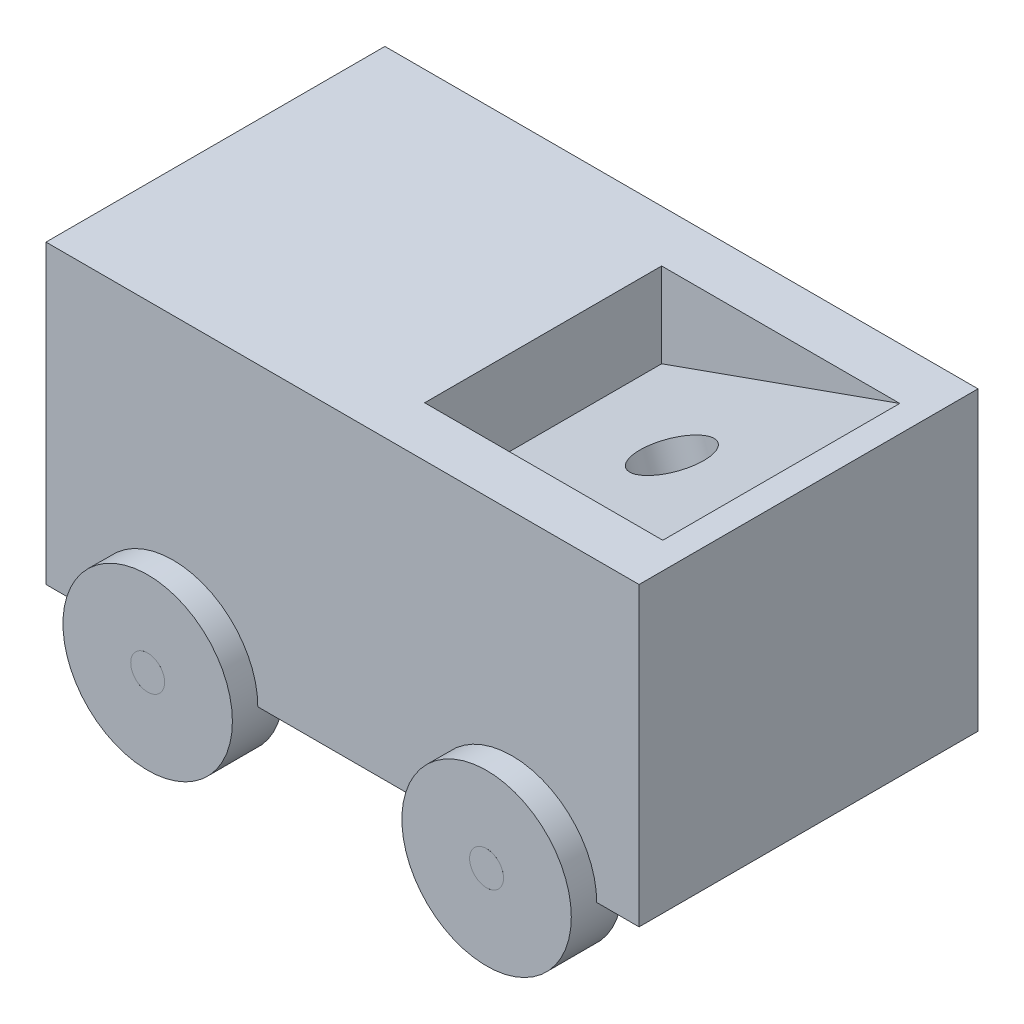
ISO-10303-21;
HEADER;
FILE_DESCRIPTION(('STEP AP214'),'2;1');
FILE_NAME('part.step','',(''),(''),'','','');
FILE_SCHEMA(('AUTOMOTIVE_DESIGN { 1 0 10303 214 1 1 1 1 }'));
ENDSEC;
DATA;
#1=APPLICATION_CONTEXT('core data for automotive mechanical design processes');
#2=APPLICATION_PROTOCOL_DEFINITION('international standard','automotive_design',2000,#1);
#3=PRODUCT_CONTEXT('',#1,'mechanical');
#4=PRODUCT('Part','Part','',(#3));
#5=PRODUCT_RELATED_PRODUCT_CATEGORY('part','',(#4));
#6=PRODUCT_DEFINITION_FORMATION('','',#4);
#7=PRODUCT_DEFINITION_CONTEXT('part definition',#1,'design');
#8=PRODUCT_DEFINITION('design','',#6,#7);
#9=PRODUCT_DEFINITION_SHAPE('','',#8);
#10=(LENGTH_UNIT() NAMED_UNIT(*) SI_UNIT(.MILLI.,.METRE.));
#11=(NAMED_UNIT(*) PLANE_ANGLE_UNIT() SI_UNIT($,.RADIAN.));
#12=(NAMED_UNIT(*) SI_UNIT($,.STERADIAN.) SOLID_ANGLE_UNIT());
#13=UNCERTAINTY_MEASURE_WITH_UNIT(LENGTH_MEASURE(1.E-05),#10,'distance_accuracy_value','');
#14=(GEOMETRIC_REPRESENTATION_CONTEXT(3) GLOBAL_UNCERTAINTY_ASSIGNED_CONTEXT((#13)) GLOBAL_UNIT_ASSIGNED_CONTEXT((#10,
#11,#12)) REPRESENTATION_CONTEXT('',''));
#15=CARTESIAN_POINT('',(0.,0.,0.));
#16=DIRECTION('',(0.,0.,1.));
#17=DIRECTION('',(1.,0.,0.));
#18=AXIS2_PLACEMENT_3D('',#15,#16,#17);
#19=CARTESIAN_POINT('',(-31.2286248123139,-10.,6.10846709352142));
#20=DIRECTION('',(0.,0.,-1.));
#21=DIRECTION('',(-1.,0.,0.));
#22=AXIS2_PLACEMENT_3D('',#19,#20,#21);
#23=PLANE('',#22);
#24=DIRECTION('',(-0.942142791010084,-0.335211815644569,0.));
#25=VECTOR('',#24,1.);
#26=CARTESIAN_POINT('',(-31.2286248123139,-10.,6.10846709352142));
#27=LINE('',#26,#25);
#28=CARTESIAN_POINT('',(-3.1227303587289,0.,6.10846709352142));
#29=VERTEX_POINT('',#28);
#30=CARTESIAN_POINT('',(-31.2286248123139,-10.,6.10846709352142));
#31=VERTEX_POINT('',#30);
#32=EDGE_CURVE('E459',#29,#31,#27,.T.);
#33=ORIENTED_EDGE('',*,*,#32,.F.);
#34=DIRECTION('',(-1.,0.,0.));
#35=VECTOR('',#34,1.);
#36=CARTESIAN_POINT('',(-31.2286248123139,0.,6.10846709352142));
#37=LINE('',#36,#35);
#38=CARTESIAN_POINT('',(-31.2286248123139,0.,6.10846709352142));
#39=VERTEX_POINT('',#38);
#40=EDGE_CURVE('E307',#29,#39,#37,.T.);
#41=ORIENTED_EDGE('',*,*,#40,.T.);
#42=DIRECTION('',(0.,1.,0.));
#43=VECTOR('',#42,1.);
#44=CARTESIAN_POINT('',(-31.2286248123139,-10.,6.10846709352142));
#45=LINE('',#44,#43);
#46=EDGE_CURVE('E320',#31,#39,#45,.T.);
#47=ORIENTED_EDGE('',*,*,#46,.F.);
#48=EDGE_LOOP('',(#33,#41,#47));
#49=FACE_BOUND('',#48,.T.);
#50=ADVANCED_FACE('F39',(#49),#23,.F.);
#51=CARTESIAN_POINT('',(-31.2286248123139,-10.,34.0804128909857));
#52=DIRECTION('',(0.,0.,1.));
#53=DIRECTION('',(1.,0.,0.));
#54=AXIS2_PLACEMENT_3D('',#51,#52,#53);
#55=PLANE('',#54);
#56=DIRECTION('',(0.942142791010084,0.335211815644569,0.));
#57=VECTOR('',#56,1.);
#58=CARTESIAN_POINT('',(-3.1227303587289,0.,34.0804128909857));
#59=LINE('',#58,#57);
#60=CARTESIAN_POINT('',(-31.2286248123139,-10.,34.0804128909857));
#61=VERTEX_POINT('',#60);
#62=CARTESIAN_POINT('',(-3.1227303587289,0.,34.0804128909857));
#63=VERTEX_POINT('',#62);
#64=EDGE_CURVE('E463',#61,#63,#59,.T.);
#65=ORIENTED_EDGE('',*,*,#64,.F.);
#66=DIRECTION('',(0.,1.,0.));
#67=VECTOR('',#66,1.);
#68=CARTESIAN_POINT('',(-31.2286248123139,-10.,34.0804128909857));
#69=LINE('',#68,#67);
#70=CARTESIAN_POINT('',(-31.2286248123139,0.,34.0804128909857));
#71=VERTEX_POINT('',#70);
#72=EDGE_CURVE('E306',#61,#71,#69,.T.);
#73=ORIENTED_EDGE('',*,*,#72,.T.);
#74=DIRECTION('',(1.,0.,0.));
#75=VECTOR('',#74,1.);
#76=CARTESIAN_POINT('',(-31.2286248123139,0.,34.0804128909857));
#77=LINE('',#76,#75);
#78=EDGE_CURVE('E310',#71,#63,#77,.T.);
#79=ORIENTED_EDGE('',*,*,#78,.T.);
#80=EDGE_LOOP('',(#65,#73,#79));
#81=FACE_BOUND('',#80,.T.);
#82=ADVANCED_FACE('F498',(#81),#55,.F.);
#83=CARTESIAN_POINT('',(0.,-35.,40.));
#84=DIRECTION('',(0.,1.,0.));
#85=DIRECTION('',(-1.,0.,0.));
#86=AXIS2_PLACEMENT_3D('',#83,#84,#85);
#87=PLANE('',#86);
#88=DIRECTION('',(1.,0.,0.));
#89=VECTOR('',#88,1.);
#90=CARTESIAN_POINT('',(0.,-35.,37.));
#91=LINE('',#90,#89);
#92=CARTESIAN_POINT('',(-13.,-35.,37.));
#93=VERTEX_POINT('',#92);
#94=CARTESIAN_POINT('',(-4.99999999999999,-35.,37.));
#95=VERTEX_POINT('',#94);
#96=EDGE_CURVE('E207',#93,#95,#91,.T.);
#97=ORIENTED_EDGE('',*,*,#96,.F.);
#98=DIRECTION('',(0.,0.,-1.));
#99=VECTOR('',#98,1.);
#100=CARTESIAN_POINT('',(-13.,-35.,43.));
#101=LINE('',#100,#99);
#102=CARTESIAN_POINT('',(-13.,-35.,3.));
#103=VERTEX_POINT('',#102);
#104=EDGE_CURVE('E382',#93,#103,#101,.T.);
#105=ORIENTED_EDGE('',*,*,#104,.T.);
#106=DIRECTION('',(-1.,0.,0.));
#107=VECTOR('',#106,1.);
#108=CARTESIAN_POINT('',(0.,-35.,3.));
#109=LINE('',#108,#107);
#110=CARTESIAN_POINT('',(-5.,-35.,3.));
#111=VERTEX_POINT('',#110);
#112=EDGE_CURVE('E11',#111,#103,#109,.T.);
#113=ORIENTED_EDGE('',*,*,#112,.F.);
#114=DIRECTION('',(0.,0.,-1.));
#115=VECTOR('',#114,1.);
#116=CARTESIAN_POINT('',(-5.,-35.,3.));
#117=LINE('',#116,#115);
#118=CARTESIAN_POINT('',(-5.,-35.,0.));
#119=VERTEX_POINT('',#118);
#120=EDGE_CURVE('E273',#111,#119,#117,.T.);
#121=ORIENTED_EDGE('',*,*,#120,.T.);
#122=DIRECTION('',(1.,0.,0.));
#123=VECTOR('',#122,1.);
#124=CARTESIAN_POINT('',(0.,-35.,0.));
#125=LINE('',#124,#123);
#126=CARTESIAN_POINT('',(0.,-35.,0.));
#127=VERTEX_POINT('',#126);
#128=EDGE_CURVE('E349',#119,#127,#125,.T.);
#129=ORIENTED_EDGE('',*,*,#128,.T.);
#130=DIRECTION('',(0.,0.,-1.));
#131=VECTOR('',#130,1.);
#132=CARTESIAN_POINT('',(0.,-35.,40.));
#133=LINE('',#132,#131);
#134=CARTESIAN_POINT('',(0.,-35.,40.));
#135=VERTEX_POINT('',#134);
#136=EDGE_CURVE('E196',#135,#127,#133,.T.);
#137=ORIENTED_EDGE('',*,*,#136,.F.);
#138=DIRECTION('',(1.,0.,0.));
#139=VECTOR('',#138,1.);
#140=CARTESIAN_POINT('',(0.,-35.,40.));
#141=LINE('',#140,#139);
#142=CARTESIAN_POINT('',(-4.99999999999999,-35.,40.));
#143=VERTEX_POINT('',#142);
#144=EDGE_CURVE('E336',#143,#135,#141,.T.);
#145=ORIENTED_EDGE('',*,*,#144,.F.);
#146=DIRECTION('',(0.,0.,1.));
#147=VECTOR('',#146,1.);
#148=CARTESIAN_POINT('',(-4.99999999999999,-35.,37.));
#149=LINE('',#148,#147);
#150=EDGE_CURVE('E293',#143,#95,#149,.F.);
#151=ORIENTED_EDGE('',*,*,#150,.T.);
#152=EDGE_LOOP('',(#97,#105,#113,#121,#129,#137,#145,#151));
#153=FACE_BOUND('',#152,.T.);
#154=ADVANCED_FACE('F380',(#153),#87,.F.);
#155=CARTESIAN_POINT('',(-17.,-35.,3.));
#156=VERTEX_POINT('',#155);
#157=CARTESIAN_POINT('',(-25.,-35.,3.));
#158=VERTEX_POINT('',#157);
#159=EDGE_CURVE('E48',#156,#158,#109,.T.);
#160=ORIENTED_EDGE('',*,*,#159,.F.);
#161=DIRECTION('',(0.,0.,-1.));
#162=VECTOR('',#161,1.);
#163=CARTESIAN_POINT('',(-17.,-35.,43.));
#164=LINE('',#163,#162);
#165=CARTESIAN_POINT('',(-17.,-35.,37.));
#166=VERTEX_POINT('',#165);
#167=EDGE_CURVE('E55',#156,#166,#164,.F.);
#168=ORIENTED_EDGE('',*,*,#167,.T.);
#169=CARTESIAN_POINT('',(-25.,-35.,37.));
#170=VERTEX_POINT('',#169);
#171=EDGE_CURVE('E208',#170,#166,#91,.T.);
#172=ORIENTED_EDGE('',*,*,#171,.F.);
#173=DIRECTION('',(0.,0.,1.));
#174=VECTOR('',#173,1.);
#175=CARTESIAN_POINT('',(-25.,-35.,37.));
#176=LINE('',#175,#174);
#177=CARTESIAN_POINT('',(-25.,-35.,40.));
#178=VERTEX_POINT('',#177);
#179=EDGE_CURVE('E297',#170,#178,#176,.T.);
#180=ORIENTED_EDGE('',*,*,#179,.T.);
#181=CARTESIAN_POINT('',(-45.,-35.,40.));
#182=VERTEX_POINT('',#181);
#183=EDGE_CURVE('E340',#182,#178,#141,.T.);
#184=ORIENTED_EDGE('',*,*,#183,.F.);
#185=DIRECTION('',(0.,0.,1.));
#186=VECTOR('',#185,1.);
#187=CARTESIAN_POINT('',(-45.,-35.,37.));
#188=LINE('',#187,#186);
#189=CARTESIAN_POINT('',(-45.,-35.,37.));
#190=VERTEX_POINT('',#189);
#191=EDGE_CURVE('E282',#182,#190,#188,.F.);
#192=ORIENTED_EDGE('',*,*,#191,.T.);
#193=DIRECTION('',(1.,0.,0.));
#194=VECTOR('',#193,1.);
#195=CARTESIAN_POINT('',(0.,-35.,37.));
#196=LINE('',#195,#194);
#197=CARTESIAN_POINT('',(-53.,-35.,37.));
#198=VERTEX_POINT('',#197);
#199=EDGE_CURVE('E202',#198,#190,#196,.T.);
#200=ORIENTED_EDGE('',*,*,#199,.F.);
#201=DIRECTION('',(0.,0.,-1.));
#202=VECTOR('',#201,1.);
#203=CARTESIAN_POINT('',(-53.,-35.,43.));
#204=LINE('',#203,#202);
#205=CARTESIAN_POINT('',(-53.,-35.,3.));
#206=VERTEX_POINT('',#205);
#207=EDGE_CURVE('E251',#198,#206,#204,.T.);
#208=ORIENTED_EDGE('',*,*,#207,.T.);
#209=DIRECTION('',(-1.,0.,0.));
#210=VECTOR('',#209,1.);
#211=CARTESIAN_POINT('',(0.,-35.,3.));
#212=LINE('',#211,#210);
#213=CARTESIAN_POINT('',(-45.,-35.,3.));
#214=VERTEX_POINT('',#213);
#215=EDGE_CURVE('E212',#214,#206,#212,.T.);
#216=ORIENTED_EDGE('',*,*,#215,.F.);
#217=DIRECTION('',(0.,0.,-1.));
#218=VECTOR('',#217,1.);
#219=CARTESIAN_POINT('',(-45.,-35.,3.));
#220=LINE('',#219,#218);
#221=CARTESIAN_POINT('',(-45.,-35.,0.));
#222=VERTEX_POINT('',#221);
#223=EDGE_CURVE('E235',#214,#222,#220,.T.);
#224=ORIENTED_EDGE('',*,*,#223,.T.);
#225=CARTESIAN_POINT('',(-25.,-35.,0.));
#226=VERTEX_POINT('',#225);
#227=EDGE_CURVE('E351',#222,#226,#125,.T.);
#228=ORIENTED_EDGE('',*,*,#227,.T.);
#229=DIRECTION('',(0.,0.,-1.));
#230=VECTOR('',#229,1.);
#231=CARTESIAN_POINT('',(-25.,-35.,3.));
#232=LINE('',#231,#230);
#233=EDGE_CURVE('E269',#226,#158,#232,.F.);
#234=ORIENTED_EDGE('',*,*,#233,.T.);
#235=EDGE_LOOP('',(#160,#168,#172,#180,#184,#192,#200,#208,#216,#224,#228,#234));
#236=FACE_BOUND('',#235,.T.);
#237=ADVANCED_FACE('F373',(#236),#87,.F.);
#238=CARTESIAN_POINT('',(0.,0.,40.));
#239=DIRECTION('',(-1.,0.,0.));
#240=DIRECTION('',(0.,-1.,0.));
#241=AXIS2_PLACEMENT_3D('',#238,#239,#240);
#242=PLANE('',#241);
#243=DIRECTION('',(0.,1.,0.));
#244=VECTOR('',#243,1.);
#245=CARTESIAN_POINT('',(0.,0.,0.));
#246=LINE('',#245,#244);
#247=CARTESIAN_POINT('',(0.,0.,0.));
#248=VERTEX_POINT('',#247);
#249=EDGE_CURVE('E323',#127,#248,#246,.T.);
#250=ORIENTED_EDGE('',*,*,#249,.T.);
#251=DIRECTION('',(0.,0.,-1.));
#252=VECTOR('',#251,1.);
#253=CARTESIAN_POINT('',(0.,0.,40.));
#254=LINE('',#253,#252);
#255=CARTESIAN_POINT('',(0.,0.,40.));
#256=VERTEX_POINT('',#255);
#257=EDGE_CURVE('E184',#256,#248,#254,.T.);
#258=ORIENTED_EDGE('',*,*,#257,.F.);
#259=DIRECTION('',(0.,1.,0.));
#260=VECTOR('',#259,1.);
#261=CARTESIAN_POINT('',(0.,0.,40.));
#262=LINE('',#261,#260);
#263=EDGE_CURVE('E327',#135,#256,#262,.T.);
#264=ORIENTED_EDGE('',*,*,#263,.F.);
#265=ORIENTED_EDGE('',*,*,#136,.T.);
#266=EDGE_LOOP('',(#250,#258,#264,#265));
#267=FACE_BOUND('',#266,.T.);
#268=ADVANCED_FACE('F41',(#267),#242,.F.);
#269=CARTESIAN_POINT('',(0.,0.,40.));
#270=DIRECTION('',(0.,-1.,0.));
#271=DIRECTION('',(0.,0.,-1.));
#272=AXIS2_PLACEMENT_3D('',#269,#270,#271);
#273=PLANE('',#272);
#274=ORIENTED_EDGE('',*,*,#40,.F.);
#275=DIRECTION('',(0.,0.,-1.));
#276=VECTOR('',#275,1.);
#277=CARTESIAN_POINT('',(-3.1227303587289,0.,34.0804128909857));
#278=LINE('',#277,#276);
#279=EDGE_CURVE('E313',#63,#29,#278,.T.);
#280=ORIENTED_EDGE('',*,*,#279,.F.);
#281=ORIENTED_EDGE('',*,*,#78,.F.);
#282=DIRECTION('',(0.,0.,1.));
#283=VECTOR('',#282,1.);
#284=CARTESIAN_POINT('',(-31.2286248123139,0.,34.0804128909857));
#285=LINE('',#284,#283);
#286=EDGE_CURVE('E301',#39,#71,#285,.T.);
#287=ORIENTED_EDGE('',*,*,#286,.F.);
#288=EDGE_LOOP('',(#274,#280,#281,#287));
#289=FACE_BOUND('',#288,.T.);
#290=DIRECTION('',(-1.,0.,0.));
#291=VECTOR('',#290,1.);
#292=CARTESIAN_POINT('',(0.,0.,0.));
#293=LINE('',#292,#291);
#294=CARTESIAN_POINT('',(-70.,0.,0.));
#295=VERTEX_POINT('',#294);
#296=EDGE_CURVE('E190',#248,#295,#293,.T.);
#297=ORIENTED_EDGE('',*,*,#296,.T.);
#298=DIRECTION('',(0.,0.,-1.));
#299=VECTOR('',#298,1.);
#300=CARTESIAN_POINT('',(-70.,0.,40.));
#301=LINE('',#300,#299);
#302=CARTESIAN_POINT('',(-70.,0.,20.));
#303=VERTEX_POINT('',#302);
#304=EDGE_CURVE('E185',#303,#295,#301,.T.);
#305=ORIENTED_EDGE('',*,*,#304,.F.);
#306=CARTESIAN_POINT('',(-70.,0.,40.));
#307=VERTEX_POINT('',#306);
#308=EDGE_CURVE('E175',#307,#303,#301,.T.);
#309=ORIENTED_EDGE('',*,*,#308,.F.);
#310=DIRECTION('',(-1.,0.,0.));
#311=VECTOR('',#310,1.);
#312=CARTESIAN_POINT('',(0.,0.,40.));
#313=LINE('',#312,#311);
#314=EDGE_CURVE('E331',#256,#307,#313,.T.);
#315=ORIENTED_EDGE('',*,*,#314,.F.);
#316=ORIENTED_EDGE('',*,*,#257,.T.);
#317=EDGE_LOOP('',(#297,#305,#309,#315,#316));
#318=FACE_BOUND('',#317,.T.);
#319=ADVANCED_FACE('F188',(#289,#318),#273,.F.);
#320=CARTESIAN_POINT('',(-70.,0.,40.));
#321=DIRECTION('',(1.,0.,0.));
#322=DIRECTION('',(0.,0.,-1.));
#323=AXIS2_PLACEMENT_3D('',#320,#321,#322);
#324=PLANE('',#323);
#325=ORIENTED_EDGE('',*,*,#308,.T.);
#326=CARTESIAN_POINT('',(-70.,-5.5,20.));
#327=DIRECTION('',(-1.,0.,0.));
#328=DIRECTION('',(0.,0.,1.));
#329=AXIS2_PLACEMENT_3D('',#326,#327,#328);
#330=CIRCLE('',#329,5.5);
#331=EDGE_CURVE('E179',#303,#303,#330,.T.);
#332=ORIENTED_EDGE('',*,*,#331,.F.);
#333=ORIENTED_EDGE('',*,*,#304,.T.);
#334=DIRECTION('',(0.,-1.,0.));
#335=VECTOR('',#334,1.);
#336=CARTESIAN_POINT('',(-70.,0.,0.));
#337=LINE('',#336,#335);
#338=CARTESIAN_POINT('',(-70.,-35.,0.));
#339=VERTEX_POINT('',#338);
#340=EDGE_CURVE('E346',#295,#339,#337,.T.);
#341=ORIENTED_EDGE('',*,*,#340,.T.);
#342=DIRECTION('',(0.,0.,-1.));
#343=VECTOR('',#342,1.);
#344=CARTESIAN_POINT('',(-70.,-35.,40.));
#345=LINE('',#344,#343);
#346=CARTESIAN_POINT('',(-70.,-35.,40.));
#347=VERTEX_POINT('',#346);
#348=EDGE_CURVE('E193',#347,#339,#345,.T.);
#349=ORIENTED_EDGE('',*,*,#348,.F.);
#350=DIRECTION('',(0.,-1.,0.));
#351=VECTOR('',#350,1.);
#352=CARTESIAN_POINT('',(-70.,0.,40.));
#353=LINE('',#352,#351);
#354=EDGE_CURVE('E181',#307,#347,#353,.T.);
#355=ORIENTED_EDGE('',*,*,#354,.F.);
#356=EDGE_LOOP('',(#325,#332,#333,#341,#349,#355));
#357=FACE_BOUND('',#356,.T.);
#358=ADVANCED_FACE('F177',(#357),#324,.F.);
#359=CARTESIAN_POINT('',(-57.,-35.,3.));
#360=VERTEX_POINT('',#359);
#361=CARTESIAN_POINT('',(-65.,-35.,3.));
#362=VERTEX_POINT('',#361);
#363=EDGE_CURVE('E211',#360,#362,#212,.T.);
#364=ORIENTED_EDGE('',*,*,#363,.F.);
#365=DIRECTION('',(0.,0.,-1.));
#366=VECTOR('',#365,1.);
#367=CARTESIAN_POINT('',(-57.,-35.,43.));
#368=LINE('',#367,#366);
#369=CARTESIAN_POINT('',(-57.,-35.,37.));
#370=VERTEX_POINT('',#369);
#371=EDGE_CURVE('E63',#360,#370,#368,.F.);
#372=ORIENTED_EDGE('',*,*,#371,.T.);
#373=CARTESIAN_POINT('',(-65.,-35.,37.));
#374=VERTEX_POINT('',#373);
#375=EDGE_CURVE('E203',#374,#370,#196,.T.);
#376=ORIENTED_EDGE('',*,*,#375,.F.);
#377=DIRECTION('',(0.,0.,1.));
#378=VECTOR('',#377,1.);
#379=CARTESIAN_POINT('',(-65.,-35.,37.));
#380=LINE('',#379,#378);
#381=CARTESIAN_POINT('',(-65.,-35.,40.));
#382=VERTEX_POINT('',#381);
#383=EDGE_CURVE('E289',#374,#382,#380,.T.);
#384=ORIENTED_EDGE('',*,*,#383,.T.);
#385=EDGE_CURVE('E337',#347,#382,#141,.T.);
#386=ORIENTED_EDGE('',*,*,#385,.F.);
#387=ORIENTED_EDGE('',*,*,#348,.T.);
#388=CARTESIAN_POINT('',(-65.,-35.,0.));
#389=VERTEX_POINT('',#388);
#390=EDGE_CURVE('E231',#339,#389,#125,.T.);
#391=ORIENTED_EDGE('',*,*,#390,.T.);
#392=DIRECTION('',(0.,0.,-1.));
#393=VECTOR('',#392,1.);
#394=CARTESIAN_POINT('',(-65.,-35.,3.));
#395=LINE('',#394,#393);
#396=EDGE_CURVE('E228',#389,#362,#395,.F.);
#397=ORIENTED_EDGE('',*,*,#396,.T.);
#398=EDGE_LOOP('',(#364,#372,#376,#384,#386,#387,#391,#397));
#399=FACE_BOUND('',#398,.T.);
#400=ADVANCED_FACE('F229',(#399),#87,.F.);
#401=CARTESIAN_POINT('',(0.,0.,40.));
#402=DIRECTION('',(0.,0.,-1.));
#403=DIRECTION('',(-1.,0.,0.));
#404=AXIS2_PLACEMENT_3D('',#401,#402,#403);
#405=PLANE('',#404);
#406=ORIENTED_EDGE('',*,*,#183,.T.);
#407=CARTESIAN_POINT('',(-15.,-35.,40.));
#408=DIRECTION('',(0.,0.,1.));
#409=DIRECTION('',(1.,0.,0.));
#410=AXIS2_PLACEMENT_3D('',#407,#408,#409);
#411=CIRCLE('',#410,10.);
#412=EDGE_CURVE('E278',#143,#178,#411,.T.);
#413=ORIENTED_EDGE('',*,*,#412,.F.);
#414=ORIENTED_EDGE('',*,*,#144,.T.);
#415=ORIENTED_EDGE('',*,*,#263,.T.);
#416=ORIENTED_EDGE('',*,*,#314,.T.);
#417=ORIENTED_EDGE('',*,*,#354,.T.);
#418=ORIENTED_EDGE('',*,*,#385,.T.);
#419=CARTESIAN_POINT('',(-55.,-35.,40.));
#420=DIRECTION('',(0.,0.,1.));
#421=DIRECTION('',(1.,0.,0.));
#422=AXIS2_PLACEMENT_3D('',#419,#420,#421);
#423=CIRCLE('',#422,10.);
#424=EDGE_CURVE('E277',#182,#382,#423,.T.);
#425=ORIENTED_EDGE('',*,*,#424,.F.);
#426=EDGE_LOOP('',(#406,#413,#414,#415,#416,#417,#418,#425));
#427=FACE_BOUND('',#426,.T.);
#428=ADVANCED_FACE('F364',(#427),#405,.F.);
#429=CARTESIAN_POINT('',(0.,0.,0.));
#430=DIRECTION('',(0.,0.,-1.));
#431=DIRECTION('',(-1.,0.,0.));
#432=AXIS2_PLACEMENT_3D('',#429,#430,#431);
#433=PLANE('',#432);
#434=CARTESIAN_POINT('',(-15.,-35.,0.));
#435=DIRECTION('',(0.,0.,-1.));
#436=DIRECTION('',(-1.,0.,0.));
#437=AXIS2_PLACEMENT_3D('',#434,#435,#436);
#438=CIRCLE('',#437,10.);
#439=EDGE_CURVE('E236',#226,#119,#438,.T.);
#440=ORIENTED_EDGE('',*,*,#439,.F.);
#441=ORIENTED_EDGE('',*,*,#227,.F.);
#442=CARTESIAN_POINT('',(-55.,-35.,0.));
#443=DIRECTION('',(0.,0.,-1.));
#444=DIRECTION('',(-1.,0.,0.));
#445=AXIS2_PLACEMENT_3D('',#442,#443,#444);
#446=CIRCLE('',#445,9.99999999999999);
#447=EDGE_CURVE('E261',#389,#222,#446,.T.);
#448=ORIENTED_EDGE('',*,*,#447,.F.);
#449=ORIENTED_EDGE('',*,*,#390,.F.);
#450=ORIENTED_EDGE('',*,*,#340,.F.);
#451=ORIENTED_EDGE('',*,*,#296,.F.);
#452=ORIENTED_EDGE('',*,*,#249,.F.);
#453=ORIENTED_EDGE('',*,*,#128,.F.);
#454=EDGE_LOOP('',(#440,#441,#448,#449,#450,#451,#452,#453));
#455=FACE_BOUND('',#454,.T.);
#456=ADVANCED_FACE('F362',(#455),#433,.T.);
#457=CARTESIAN_POINT('',(-31.2286248123139,-10.,34.0804128909857));
#458=DIRECTION('',(-1.,0.,0.));
#459=DIRECTION('',(0.,0.,1.));
#460=AXIS2_PLACEMENT_3D('',#457,#458,#459);
#461=PLANE('',#460);
#462=ORIENTED_EDGE('',*,*,#286,.T.);
#463=ORIENTED_EDGE('',*,*,#72,.F.);
#464=DIRECTION('',(0.,0.,1.));
#465=VECTOR('',#464,1.);
#466=CARTESIAN_POINT('',(-31.2286248123139,-10.,34.0804128909857));
#467=LINE('',#466,#465);
#468=EDGE_CURVE('E302',#31,#61,#467,.T.);
#469=ORIENTED_EDGE('',*,*,#468,.F.);
#470=ORIENTED_EDGE('',*,*,#46,.T.);
#471=EDGE_LOOP('',(#462,#463,#469,#470));
#472=FACE_BOUND('',#471,.T.);
#473=ADVANCED_FACE('F509',(#472),#461,.F.);
#474=CARTESIAN_POINT('',(-55.,-35.,37.));
#475=DIRECTION('',(0.,0.,1.));
#476=DIRECTION('',(1.,0.,0.));
#477=AXIS2_PLACEMENT_3D('',#474,#475,#476);
#478=CYLINDRICAL_SURFACE('',#477,10.);
#479=CARTESIAN_POINT('',(-55.,-35.,43.));
#480=DIRECTION('',(0.,0.,1.));
#481=DIRECTION('',(1.,0.,0.));
#482=AXIS2_PLACEMENT_3D('',#479,#480,#481);
#483=CIRCLE('',#482,10.);
#484=CARTESIAN_POINT('',(-45.,-35.,43.));
#485=VERTEX_POINT('',#484);
#486=EDGE_CURVE('E248',#485,#485,#483,.T.);
#487=ORIENTED_EDGE('',*,*,#486,.F.);
#488=EDGE_LOOP('',(#487));
#489=FACE_BOUND('',#488,.T.);
#490=ORIENTED_EDGE('',*,*,#383,.F.);
#491=CARTESIAN_POINT('',(-55.,-35.,37.));
#492=DIRECTION('',(0.,0.,1.));
#493=DIRECTION('',(1.,0.,0.));
#494=AXIS2_PLACEMENT_3D('',#491,#492,#493);
#495=CIRCLE('',#494,10.);
#496=EDGE_CURVE('E257',#374,#190,#495,.T.);
#497=ORIENTED_EDGE('',*,*,#496,.T.);
#498=ORIENTED_EDGE('',*,*,#191,.F.);
#499=ORIENTED_EDGE('',*,*,#424,.T.);
#500=EDGE_LOOP('',(#490,#497,#498,#499));
#501=FACE_BOUND('',#500,.T.);
#502=ADVANCED_FACE('F394',(#489,#501),#478,.T.);
#503=CARTESIAN_POINT('',(-55.,-35.,37.));
#504=DIRECTION('',(0.,0.,1.));
#505=DIRECTION('',(1.,0.,0.));
#506=AXIS2_PLACEMENT_3D('',#503,#504,#505);
#507=PLANE('',#506);
#508=ORIENTED_EDGE('',*,*,#375,.T.);
#509=CARTESIAN_POINT('',(-55.,-35.,37.));
#510=DIRECTION('',(0.,0.,1.));
#511=DIRECTION('',(1.,0.,0.));
#512=AXIS2_PLACEMENT_3D('',#509,#510,#511);
#513=CIRCLE('',#512,2.);
#514=EDGE_CURVE('E243',#370,#198,#513,.T.);
#515=ORIENTED_EDGE('',*,*,#514,.T.);
#516=ORIENTED_EDGE('',*,*,#199,.T.);
#517=ORIENTED_EDGE('',*,*,#496,.F.);
#518=EDGE_LOOP('',(#508,#515,#516,#517));
#519=FACE_BOUND('',#518,.T.);
#520=ADVANCED_FACE('F390',(#519),#507,.F.);
#521=CARTESIAN_POINT('',(-55.,-35.,43.));
#522=DIRECTION('',(0.,0.,1.));
#523=DIRECTION('',(1.,0.,0.));
#524=AXIS2_PLACEMENT_3D('',#521,#522,#523);
#525=PLANE('',#524);
#526=CARTESIAN_POINT('',(-55.,-35.,43.));
#527=DIRECTION('',(0.,0.,1.));
#528=DIRECTION('',(1.,0.,0.));
#529=AXIS2_PLACEMENT_3D('',#526,#527,#528);
#530=CIRCLE('',#529,2.);
#531=CARTESIAN_POINT('',(-53.,-35.,43.));
#532=VERTEX_POINT('',#531);
#533=EDGE_CURVE('E407',#532,#532,#530,.T.);
#534=ORIENTED_EDGE('',*,*,#533,.F.);
#535=EDGE_LOOP('',(#534));
#536=FACE_BOUND('',#535,.T.);
#537=ORIENTED_EDGE('',*,*,#486,.T.);
#538=EDGE_LOOP('',(#537));
#539=FACE_BOUND('',#538,.T.);
#540=ADVANCED_FACE('F601',(#536,#539),#525,.T.);
#541=CARTESIAN_POINT('',(-55.,-35.,-3.));
#542=DIRECTION('',(0.,0.,1.));
#543=DIRECTION('',(1.,0.,0.));
#544=AXIS2_PLACEMENT_3D('',#541,#542,#543);
#545=CYLINDRICAL_SURFACE('',#544,9.99999999999999);
#546=CARTESIAN_POINT('',(-55.,-35.,-3.));
#547=DIRECTION('',(0.,0.,-1.));
#548=DIRECTION('',(-1.,0.,0.));
#549=AXIS2_PLACEMENT_3D('',#546,#547,#548);
#550=CIRCLE('',#549,9.99999999999999);
#551=CARTESIAN_POINT('',(-65.,-35.,-3.));
#552=VERTEX_POINT('',#551);
#553=EDGE_CURVE('E242',#552,#552,#550,.T.);
#554=ORIENTED_EDGE('',*,*,#553,.F.);
#555=EDGE_LOOP('',(#554));
#556=FACE_BOUND('',#555,.T.);
#557=CARTESIAN_POINT('',(-55.,-35.,3.));
#558=DIRECTION('',(0.,0.,-1.));
#559=DIRECTION('',(-1.,0.,0.));
#560=AXIS2_PLACEMENT_3D('',#557,#558,#559);
#561=CIRCLE('',#560,9.99999999999999);
#562=EDGE_CURVE('E223',#214,#362,#561,.T.);
#563=ORIENTED_EDGE('',*,*,#562,.T.);
#564=ORIENTED_EDGE('',*,*,#396,.F.);
#565=ORIENTED_EDGE('',*,*,#447,.T.);
#566=ORIENTED_EDGE('',*,*,#223,.F.);
#567=EDGE_LOOP('',(#563,#564,#565,#566));
#568=FACE_BOUND('',#567,.T.);
#569=ADVANCED_FACE('F239',(#556,#568),#545,.T.);
#570=CARTESIAN_POINT('',(-55.,-35.,3.));
#571=DIRECTION('',(0.,0.,-1.));
#572=DIRECTION('',(-1.,0.,0.));
#573=AXIS2_PLACEMENT_3D('',#570,#571,#572);
#574=PLANE('',#573);
#575=ORIENTED_EDGE('',*,*,#215,.T.);
#576=CARTESIAN_POINT('',(-55.,-35.,3.));
#577=DIRECTION('',(0.,0.,-1.));
#578=DIRECTION('',(-1.,0.,0.));
#579=AXIS2_PLACEMENT_3D('',#576,#577,#578);
#580=CIRCLE('',#579,2.);
#581=EDGE_CURVE('E224',#206,#360,#580,.T.);
#582=ORIENTED_EDGE('',*,*,#581,.T.);
#583=ORIENTED_EDGE('',*,*,#363,.T.);
#584=ORIENTED_EDGE('',*,*,#562,.F.);
#585=EDGE_LOOP('',(#575,#582,#583,#584));
#586=FACE_BOUND('',#585,.T.);
#587=ADVANCED_FACE('F221',(#586),#574,.F.);
#588=CARTESIAN_POINT('',(-55.,-35.,-3.));
#589=DIRECTION('',(0.,0.,-1.));
#590=DIRECTION('',(-1.,0.,0.));
#591=AXIS2_PLACEMENT_3D('',#588,#589,#590);
#592=PLANE('',#591);
#593=CARTESIAN_POINT('',(-55.,-35.,-3.));
#594=DIRECTION('',(0.,0.,-1.));
#595=DIRECTION('',(-1.,0.,0.));
#596=AXIS2_PLACEMENT_3D('',#593,#594,#595);
#597=CIRCLE('',#596,2.);
#598=CARTESIAN_POINT('',(-57.,-35.,-3.));
#599=VERTEX_POINT('',#598);
#600=EDGE_CURVE('E401',#599,#599,#597,.T.);
#601=ORIENTED_EDGE('',*,*,#600,.F.);
#602=EDGE_LOOP('',(#601));
#603=FACE_BOUND('',#602,.T.);
#604=ORIENTED_EDGE('',*,*,#553,.T.);
#605=EDGE_LOOP('',(#604));
#606=FACE_BOUND('',#605,.T.);
#607=ADVANCED_FACE('F584',(#603,#606),#592,.T.);
#608=CARTESIAN_POINT('',(-55.,-35.,-3.0001));
#609=DIRECTION('',(0.,0.,-1.));
#610=DIRECTION('',(-1.,0.,0.));
#611=AXIS2_PLACEMENT_3D('',#608,#609,#610);
#612=PLANE('',#611);
#613=CARTESIAN_POINT('',(-55.,-35.,-3.0001));
#614=DIRECTION('',(0.,0.,-1.));
#615=DIRECTION('',(-1.,0.,0.));
#616=AXIS2_PLACEMENT_3D('',#613,#614,#615);
#617=CIRCLE('',#616,2.);
#618=CARTESIAN_POINT('',(-57.,-35.,-3.0001));
#619=VERTEX_POINT('',#618);
#620=EDGE_CURVE('E415',#619,#619,#617,.T.);
#621=ORIENTED_EDGE('',*,*,#620,.T.);
#622=EDGE_LOOP('',(#621));
#623=FACE_BOUND('',#622,.T.);
#624=ADVANCED_FACE('F580',(#623),#612,.T.);
#625=CARTESIAN_POINT('',(-55.,-35.,43.0001));
#626=DIRECTION('',(0.,0.,-1.));
#627=DIRECTION('',(-1.,0.,0.));
#628=AXIS2_PLACEMENT_3D('',#625,#626,#627);
#629=CYLINDRICAL_SURFACE('',#628,2.);
#630=ORIENTED_EDGE('',*,*,#600,.T.);
#631=EDGE_LOOP('',(#630));
#632=FACE_BOUND('',#631,.T.);
#633=ORIENTED_EDGE('',*,*,#620,.F.);
#634=EDGE_LOOP('',(#633));
#635=FACE_BOUND('',#634,.T.);
#636=ADVANCED_FACE('F583',(#632,#635),#629,.T.);
#637=ORIENTED_EDGE('',*,*,#514,.F.);
#638=ORIENTED_EDGE('',*,*,#371,.F.);
#639=ORIENTED_EDGE('',*,*,#581,.F.);
#640=ORIENTED_EDGE('',*,*,#207,.F.);
#641=EDGE_LOOP('',(#637,#638,#639,#640));
#642=FACE_BOUND('',#641,.T.);
#643=ADVANCED_FACE('F592',(#642),#629,.T.);
#644=ORIENTED_EDGE('',*,*,#533,.T.);
#645=EDGE_LOOP('',(#644));
#646=FACE_BOUND('',#645,.T.);
#647=CARTESIAN_POINT('',(-55.,-35.,43.0001));
#648=DIRECTION('',(0.,0.,-1.));
#649=DIRECTION('',(-1.,0.,0.));
#650=AXIS2_PLACEMENT_3D('',#647,#648,#649);
#651=CIRCLE('',#650,2.);
#652=CARTESIAN_POINT('',(-57.,-35.,43.0001));
#653=VERTEX_POINT('',#652);
#654=EDGE_CURVE('E411',#653,#653,#651,.T.);
#655=ORIENTED_EDGE('',*,*,#654,.T.);
#656=EDGE_LOOP('',(#655));
#657=FACE_BOUND('',#656,.T.);
#658=ADVANCED_FACE('F588',(#646,#657),#629,.T.);
#659=CARTESIAN_POINT('',(-55.,-35.,43.0001));
#660=DIRECTION('',(0.,0.,-1.));
#661=DIRECTION('',(-1.,0.,0.));
#662=AXIS2_PLACEMENT_3D('',#659,#660,#661);
#663=PLANE('',#662);
#664=ORIENTED_EDGE('',*,*,#654,.F.);
#665=EDGE_LOOP('',(#664));
#666=FACE_BOUND('',#665,.T.);
#667=ADVANCED_FACE('F578',(#666),#663,.F.);
#668=CARTESIAN_POINT('',(-15.,-35.,37.));
#669=DIRECTION('',(0.,0.,1.));
#670=DIRECTION('',(1.,0.,0.));
#671=AXIS2_PLACEMENT_3D('',#668,#669,#670);
#672=CYLINDRICAL_SURFACE('',#671,10.);
#673=CARTESIAN_POINT('',(-15.,-35.,43.));
#674=DIRECTION('',(0.,0.,1.));
#675=DIRECTION('',(1.,0.,0.));
#676=AXIS2_PLACEMENT_3D('',#673,#674,#675);
#677=CIRCLE('',#676,10.);
#678=CARTESIAN_POINT('',(-4.99999999999999,-35.,43.));
#679=VERTEX_POINT('',#678);
#680=EDGE_CURVE('E421',#679,#679,#677,.T.);
#681=ORIENTED_EDGE('',*,*,#680,.F.);
#682=EDGE_LOOP('',(#681));
#683=FACE_BOUND('',#682,.T.);
#684=ORIENTED_EDGE('',*,*,#179,.F.);
#685=CARTESIAN_POINT('',(-15.,-35.,37.));
#686=DIRECTION('',(0.,0.,1.));
#687=DIRECTION('',(1.,0.,0.));
#688=AXIS2_PLACEMENT_3D('',#685,#686,#687);
#689=CIRCLE('',#688,10.);
#690=EDGE_CURVE('E378',#170,#95,#689,.T.);
#691=ORIENTED_EDGE('',*,*,#690,.T.);
#692=ORIENTED_EDGE('',*,*,#150,.F.);
#693=ORIENTED_EDGE('',*,*,#412,.T.);
#694=EDGE_LOOP('',(#684,#691,#692,#693));
#695=FACE_BOUND('',#694,.T.);
#696=ADVANCED_FACE('F377',(#683,#695),#672,.T.);
#697=CARTESIAN_POINT('',(-15.,-35.,37.));
#698=DIRECTION('',(0.,0.,1.));
#699=DIRECTION('',(1.,0.,0.));
#700=AXIS2_PLACEMENT_3D('',#697,#698,#699);
#701=PLANE('',#700);
#702=ORIENTED_EDGE('',*,*,#171,.T.);
#703=CARTESIAN_POINT('',(-15.,-35.,37.));
#704=DIRECTION('',(0.,0.,1.));
#705=DIRECTION('',(1.,0.,0.));
#706=AXIS2_PLACEMENT_3D('',#703,#704,#705);
#707=CIRCLE('',#706,2.);
#708=EDGE_CURVE('E433',#166,#93,#707,.T.);
#709=ORIENTED_EDGE('',*,*,#708,.T.);
#710=ORIENTED_EDGE('',*,*,#96,.T.);
#711=ORIENTED_EDGE('',*,*,#690,.F.);
#712=EDGE_LOOP('',(#702,#709,#710,#711));
#713=FACE_BOUND('',#712,.T.);
#714=ADVANCED_FACE('F572',(#713),#701,.F.);
#715=CARTESIAN_POINT('',(-15.,-35.,43.));
#716=DIRECTION('',(0.,0.,1.));
#717=DIRECTION('',(1.,0.,0.));
#718=AXIS2_PLACEMENT_3D('',#715,#716,#717);
#719=PLANE('',#718);
#720=CARTESIAN_POINT('',(-15.,-35.,43.));
#721=DIRECTION('',(0.,0.,1.));
#722=DIRECTION('',(1.,0.,0.));
#723=AXIS2_PLACEMENT_3D('',#720,#721,#722);
#724=CIRCLE('',#723,2.);
#725=CARTESIAN_POINT('',(-13.,-35.,43.));
#726=VERTEX_POINT('',#725);
#727=EDGE_CURVE('E447',#726,#726,#724,.T.);
#728=ORIENTED_EDGE('',*,*,#727,.F.);
#729=EDGE_LOOP('',(#728));
#730=FACE_BOUND('',#729,.T.);
#731=ORIENTED_EDGE('',*,*,#680,.T.);
#732=EDGE_LOOP('',(#731));
#733=FACE_BOUND('',#732,.T.);
#734=ADVANCED_FACE('F568',(#730,#733),#719,.T.);
#735=CARTESIAN_POINT('',(-15.,-35.,3.));
#736=DIRECTION('',(0.,0.,-1.));
#737=DIRECTION('',(-1.,0.,0.));
#738=AXIS2_PLACEMENT_3D('',#735,#736,#737);
#739=CYLINDRICAL_SURFACE('',#738,10.);
#740=CARTESIAN_POINT('',(-15.,-35.,-3.));
#741=DIRECTION('',(0.,0.,-1.));
#742=DIRECTION('',(-1.,0.,0.));
#743=AXIS2_PLACEMENT_3D('',#740,#741,#742);
#744=CIRCLE('',#743,10.);
#745=CARTESIAN_POINT('',(-25.,-35.,-3.));
#746=VERTEX_POINT('',#745);
#747=EDGE_CURVE('E429',#746,#746,#744,.T.);
#748=ORIENTED_EDGE('',*,*,#747,.F.);
#749=EDGE_LOOP('',(#748));
#750=FACE_BOUND('',#749,.T.);
#751=ORIENTED_EDGE('',*,*,#120,.F.);
#752=CARTESIAN_POINT('',(-15.,-35.,3.));
#753=DIRECTION('',(0.,0.,-1.));
#754=DIRECTION('',(-1.,0.,0.));
#755=AXIS2_PLACEMENT_3D('',#752,#753,#754);
#756=CIRCLE('',#755,10.);
#757=EDGE_CURVE('E425',#111,#158,#756,.T.);
#758=ORIENTED_EDGE('',*,*,#757,.T.);
#759=ORIENTED_EDGE('',*,*,#233,.F.);
#760=ORIENTED_EDGE('',*,*,#439,.T.);
#761=EDGE_LOOP('',(#751,#758,#759,#760));
#762=FACE_BOUND('',#761,.T.);
#763=ADVANCED_FACE('F564',(#750,#762),#739,.T.);
#764=CARTESIAN_POINT('',(-15.,-35.,3.));
#765=DIRECTION('',(0.,0.,-1.));
#766=DIRECTION('',(-1.,0.,0.));
#767=AXIS2_PLACEMENT_3D('',#764,#765,#766);
#768=PLANE('',#767);
#769=ORIENTED_EDGE('',*,*,#112,.T.);
#770=CARTESIAN_POINT('',(-15.,-35.,3.));
#771=DIRECTION('',(0.,0.,-1.));
#772=DIRECTION('',(-1.,0.,0.));
#773=AXIS2_PLACEMENT_3D('',#770,#771,#772);
#774=CIRCLE('',#773,2.);
#775=EDGE_CURVE('E440',#103,#156,#774,.T.);
#776=ORIENTED_EDGE('',*,*,#775,.T.);
#777=ORIENTED_EDGE('',*,*,#159,.T.);
#778=ORIENTED_EDGE('',*,*,#757,.F.);
#779=EDGE_LOOP('',(#769,#776,#777,#778));
#780=FACE_BOUND('',#779,.T.);
#781=ADVANCED_FACE('F560',(#780),#768,.F.);
#782=CARTESIAN_POINT('',(-15.,-35.,-3.));
#783=DIRECTION('',(0.,0.,-1.));
#784=DIRECTION('',(-1.,0.,0.));
#785=AXIS2_PLACEMENT_3D('',#782,#783,#784);
#786=PLANE('',#785);
#787=CARTESIAN_POINT('',(-15.,-35.,-3.));
#788=DIRECTION('',(0.,0.,-1.));
#789=DIRECTION('',(-1.,0.,0.));
#790=AXIS2_PLACEMENT_3D('',#787,#788,#789);
#791=CIRCLE('',#790,2.);
#792=CARTESIAN_POINT('',(-17.,-35.,-3.));
#793=VERTEX_POINT('',#792);
#794=EDGE_CURVE('E443',#793,#793,#791,.T.);
#795=ORIENTED_EDGE('',*,*,#794,.F.);
#796=EDGE_LOOP('',(#795));
#797=FACE_BOUND('',#796,.T.);
#798=ORIENTED_EDGE('',*,*,#747,.T.);
#799=EDGE_LOOP('',(#798));
#800=FACE_BOUND('',#799,.T.);
#801=ADVANCED_FACE('F551',(#797,#800),#786,.T.);
#802=CARTESIAN_POINT('',(-15.,-35.,-3.001));
#803=DIRECTION('',(0.,0.,-1.));
#804=DIRECTION('',(-1.,0.,0.));
#805=AXIS2_PLACEMENT_3D('',#802,#803,#804);
#806=PLANE('',#805);
#807=CARTESIAN_POINT('',(-15.,-35.,-3.001));
#808=DIRECTION('',(0.,0.,-1.));
#809=DIRECTION('',(-1.,0.,0.));
#810=AXIS2_PLACEMENT_3D('',#807,#808,#809);
#811=CIRCLE('',#810,2.);
#812=CARTESIAN_POINT('',(-17.,-35.,-3.001));
#813=VERTEX_POINT('',#812);
#814=EDGE_CURVE('E455',#813,#813,#811,.T.);
#815=ORIENTED_EDGE('',*,*,#814,.T.);
#816=EDGE_LOOP('',(#815));
#817=FACE_BOUND('',#816,.T.);
#818=ADVANCED_FACE('F548',(#817),#806,.T.);
#819=CARTESIAN_POINT('',(-15.,-35.,43.001));
#820=DIRECTION('',(0.,0.,-1.));
#821=DIRECTION('',(-1.,0.,0.));
#822=AXIS2_PLACEMENT_3D('',#819,#820,#821);
#823=CYLINDRICAL_SURFACE('',#822,2.);
#824=ORIENTED_EDGE('',*,*,#794,.T.);
#825=EDGE_LOOP('',(#824));
#826=FACE_BOUND('',#825,.T.);
#827=ORIENTED_EDGE('',*,*,#814,.F.);
#828=EDGE_LOOP('',(#827));
#829=FACE_BOUND('',#828,.T.);
#830=ADVANCED_FACE('F550',(#826,#829),#823,.T.);
#831=ORIENTED_EDGE('',*,*,#708,.F.);
#832=ORIENTED_EDGE('',*,*,#167,.F.);
#833=ORIENTED_EDGE('',*,*,#775,.F.);
#834=ORIENTED_EDGE('',*,*,#104,.F.);
#835=EDGE_LOOP('',(#831,#832,#833,#834));
#836=FACE_BOUND('',#835,.T.);
#837=ADVANCED_FACE('F556',(#836),#823,.T.);
#838=ORIENTED_EDGE('',*,*,#727,.T.);
#839=EDGE_LOOP('',(#838));
#840=FACE_BOUND('',#839,.T.);
#841=CARTESIAN_POINT('',(-15.,-35.,43.001));
#842=DIRECTION('',(0.,0.,-1.));
#843=DIRECTION('',(-1.,0.,0.));
#844=AXIS2_PLACEMENT_3D('',#841,#842,#843);
#845=CIRCLE('',#844,2.);
#846=CARTESIAN_POINT('',(-17.,-35.,43.001));
#847=VERTEX_POINT('',#846);
#848=EDGE_CURVE('E451',#847,#847,#845,.T.);
#849=ORIENTED_EDGE('',*,*,#848,.T.);
#850=EDGE_LOOP('',(#849));
#851=FACE_BOUND('',#850,.T.);
#852=ADVANCED_FACE('F543',(#840,#851),#823,.T.);
#853=CARTESIAN_POINT('',(-15.,-35.,43.001));
#854=DIRECTION('',(0.,0.,-1.));
#855=DIRECTION('',(-1.,0.,0.));
#856=AXIS2_PLACEMENT_3D('',#853,#854,#855);
#857=PLANE('',#856);
#858=ORIENTED_EDGE('',*,*,#848,.F.);
#859=EDGE_LOOP('',(#858));
#860=FACE_BOUND('',#859,.T.);
#861=ADVANCED_FACE('F534',(#860),#857,.F.);
#862=CARTESIAN_POINT('',(-3.1227303587289,0.,6.08041289098572));
#863=DIRECTION('',(0.335211815644569,-0.942142791010084,0.));
#864=DIRECTION('',(0.942142791010084,0.335211815644569,0.));
#865=AXIS2_PLACEMENT_3D('',#862,#863,#864);
#866=PLANE('',#865);
#867=CARTESIAN_POINT('',(-15.777848312409,-4.50265618643773,20.3525356370449));
#868=DIRECTION('',(-0.335211815644569,0.942142791010084,0.));
#869=DIRECTION('',(-0.942142791010084,-0.335211815644569,0.));
#870=AXIS2_PLACEMENT_3D('',#867,#868,#869);
#871=CIRCLE('',#870,4.);
#872=CARTESIAN_POINT('',(-19.5464194764493,-5.84350344901601,20.3525356370449));
#873=VERTEX_POINT('',#872);
#874=EDGE_CURVE('E468',#873,#873,#871,.T.);
#875=ORIENTED_EDGE('',*,*,#874,.F.);
#876=EDGE_LOOP('',(#875));
#877=FACE_BOUND('',#876,.T.);
#878=ORIENTED_EDGE('',*,*,#279,.T.);
#879=ORIENTED_EDGE('',*,*,#32,.T.);
#880=ORIENTED_EDGE('',*,*,#468,.T.);
#881=ORIENTED_EDGE('',*,*,#64,.T.);
#882=EDGE_LOOP('',(#878,#879,#880,#881));
#883=FACE_BOUND('',#882,.T.);
#884=ADVANCED_FACE('F530',(#877,#883),#866,.F.);
#885=CARTESIAN_POINT('',(-12.4257301559633,-13.9240840965386,20.3525356370449));
#886=DIRECTION('',(-0.335211815644569,0.942142791010084,0.));
#887=DIRECTION('',(-0.942142791010084,-0.335211815644569,0.));
#888=AXIS2_PLACEMENT_3D('',#885,#886,#887);
#889=CYLINDRICAL_SURFACE('',#888,4.);
#890=CARTESIAN_POINT('',(-12.4257301559633,-13.9240840965386,20.3525356370449));
#891=DIRECTION('',(-0.335211815644569,0.942142791010084,0.));
#892=DIRECTION('',(-0.942142791010084,-0.335211815644569,0.));
#893=AXIS2_PLACEMENT_3D('',#890,#891,#892);
#894=CIRCLE('',#893,4.);
#895=CARTESIAN_POINT('',(-16.1943013200036,-15.2649313591169,20.3525356370449));
#896=VERTEX_POINT('',#895);
#897=EDGE_CURVE('E467',#896,#896,#894,.T.);
#898=ORIENTED_EDGE('',*,*,#897,.F.);
#899=EDGE_LOOP('',(#898));
#900=FACE_BOUND('',#899,.T.);
#901=ORIENTED_EDGE('',*,*,#874,.T.);
#902=EDGE_LOOP('',(#901));
#903=FACE_BOUND('',#902,.T.);
#904=ADVANCED_FACE('F494',(#900,#903),#889,.F.);
#905=CARTESIAN_POINT('',(-12.4257301559633,-13.9240840965386,20.3525356370449));
#906=DIRECTION('',(-0.335211815644569,0.942142791010084,0.));
#907=DIRECTION('',(-0.942142791010084,-0.335211815644569,0.));
#908=AXIS2_PLACEMENT_3D('',#905,#906,#907);
#909=PLANE('',#908);
#910=ORIENTED_EDGE('',*,*,#897,.T.);
#911=EDGE_LOOP('',(#910));
#912=FACE_BOUND('',#911,.T.);
#913=ADVANCED_FACE('F487',(#912),#909,.T.);
#914=CARTESIAN_POINT('',(-70.001,-5.5,20.));
#915=DIRECTION('',(1.,0.,0.));
#916=DIRECTION('',(0.,0.,-1.));
#917=AXIS2_PLACEMENT_3D('',#914,#915,#916);
#918=CYLINDRICAL_SURFACE('',#917,5.5);
#919=CARTESIAN_POINT('',(-70.001,-5.5,20.));
#920=DIRECTION('',(-1.,0.,0.));
#921=DIRECTION('',(0.,0.,1.));
#922=AXIS2_PLACEMENT_3D('',#919,#920,#921);
#923=CIRCLE('',#922,5.5);
#924=CARTESIAN_POINT('',(-70.001,-5.5,25.5));
#925=VERTEX_POINT('',#924);
#926=EDGE_CURVE('E472',#925,#925,#923,.T.);
#927=ORIENTED_EDGE('',*,*,#926,.F.);
#928=EDGE_LOOP('',(#927));
#929=FACE_BOUND('',#928,.T.);
#930=ORIENTED_EDGE('',*,*,#331,.T.);
#931=EDGE_LOOP('',(#930));
#932=FACE_BOUND('',#931,.T.);
#933=ADVANCED_FACE('F484',(#929,#932),#918,.T.);
#934=CARTESIAN_POINT('',(-70.001,-5.5,20.));
#935=DIRECTION('',(-1.,0.,0.));
#936=DIRECTION('',(0.,0.,1.));
#937=AXIS2_PLACEMENT_3D('',#934,#935,#936);
#938=PLANE('',#937);
#939=ORIENTED_EDGE('',*,*,#926,.T.);
#940=EDGE_LOOP('',(#939));
#941=FACE_BOUND('',#940,.T.);
#942=ADVANCED_FACE('F482',(#941),#938,.T.);
#943=CLOSED_SHELL('',(#50,#82,#154,#237,#268,#319,#358,#400,#428,#456,#473,#502,#520,#540,#569,
#587,#607,#624,#636,#643,#658,#667,#696,#714,#734,#763,#781,#801,#818,#830,#837,#852,#861,#884,
#904,#913,#933,#942));
#944=MANIFOLD_SOLID_BREP('B2',#943);
#945=ADVANCED_BREP_SHAPE_REPRESENTATION('',(#18,#944),#14);
#946=SHAPE_DEFINITION_REPRESENTATION(#9,#945);
ENDSEC;
END-ISO-10303-21;
